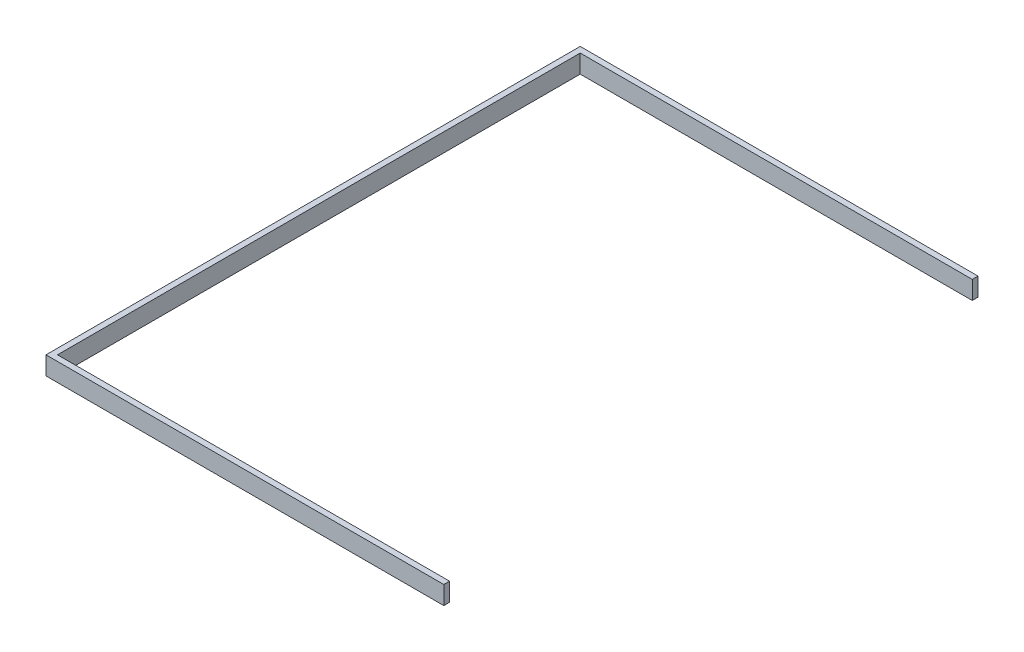
ISO-10303-21;
HEADER;
FILE_DESCRIPTION(('STEP AP214'),'2;1');
FILE_NAME('part.step','',(''),(''),'','','');
FILE_SCHEMA(('AUTOMOTIVE_DESIGN { 1 0 10303 214 1 1 1 1 }'));
ENDSEC;
DATA;
#1=APPLICATION_CONTEXT('core data for automotive mechanical design processes');
#2=APPLICATION_PROTOCOL_DEFINITION('international standard','automotive_design',2000,#1);
#3=PRODUCT_CONTEXT('',#1,'mechanical');
#4=PRODUCT('Part','Part','',(#3));
#5=PRODUCT_RELATED_PRODUCT_CATEGORY('part','',(#4));
#6=PRODUCT_DEFINITION_FORMATION('','',#4);
#7=PRODUCT_DEFINITION_CONTEXT('part definition',#1,'design');
#8=PRODUCT_DEFINITION('design','',#6,#7);
#9=PRODUCT_DEFINITION_SHAPE('','',#8);
#10=(LENGTH_UNIT() NAMED_UNIT(*) SI_UNIT(.MILLI.,.METRE.));
#11=(NAMED_UNIT(*) PLANE_ANGLE_UNIT() SI_UNIT($,.RADIAN.));
#12=(NAMED_UNIT(*) SI_UNIT($,.STERADIAN.) SOLID_ANGLE_UNIT());
#13=UNCERTAINTY_MEASURE_WITH_UNIT(LENGTH_MEASURE(1.E-05),#10,'distance_accuracy_value','');
#14=(GEOMETRIC_REPRESENTATION_CONTEXT(3) GLOBAL_UNCERTAINTY_ASSIGNED_CONTEXT((#13)) GLOBAL_UNIT_ASSIGNED_CONTEXT((#10,
#11,#12)) REPRESENTATION_CONTEXT('',''));
#15=CARTESIAN_POINT('',(0.,0.,0.));
#16=DIRECTION('',(0.,0.,1.));
#17=DIRECTION('',(1.,0.,0.));
#18=AXIS2_PLACEMENT_3D('',#15,#16,#17);
#19=CARTESIAN_POINT('',(22.,-0.01,2022.01));
#20=DIRECTION('',(1.,0.,0.));
#21=DIRECTION('',(0.,0.,-1.));
#22=AXIS2_PLACEMENT_3D('',#19,#20,#21);
#23=PLANE('',#22);
#24=DIRECTION('',(0.,0.,-1.));
#25=VECTOR('',#24,1.);
#26=CARTESIAN_POINT('',(22.,70.,1022.));
#27=LINE('',#26,#25);
#28=CARTESIAN_POINT('',(22.,70.,2022.));
#29=VERTEX_POINT('',#28);
#30=CARTESIAN_POINT('',(22.,70.,21.9999999999999));
#31=VERTEX_POINT('',#30);
#32=EDGE_CURVE('E136',#29,#31,#27,.T.);
#33=ORIENTED_EDGE('',*,*,#32,.F.);
#34=DIRECTION('',(0.,1.,0.));
#35=VECTOR('',#34,1.);
#36=CARTESIAN_POINT('',(22.0000000000001,35.,2022.));
#37=LINE('',#36,#35);
#38=CARTESIAN_POINT('',(22.0000000000001,0.,2022.));
#39=VERTEX_POINT('',#38);
#40=EDGE_CURVE('E125',#39,#29,#37,.T.);
#41=ORIENTED_EDGE('',*,*,#40,.F.);
#42=DIRECTION('',(0.,0.,1.));
#43=VECTOR('',#42,1.);
#44=CARTESIAN_POINT('',(22.0000000000001,0.,1022.));
#45=LINE('',#44,#43);
#46=CARTESIAN_POINT('',(22.,0.,22.));
#47=VERTEX_POINT('',#46);
#48=EDGE_CURVE('E124',#47,#39,#45,.T.);
#49=ORIENTED_EDGE('',*,*,#48,.F.);
#50=DIRECTION('',(0.,-1.,0.));
#51=VECTOR('',#50,1.);
#52=CARTESIAN_POINT('',(22.,35.,22.));
#53=LINE('',#52,#51);
#54=EDGE_CURVE('E21',#31,#47,#53,.T.);
#55=ORIENTED_EDGE('',*,*,#54,.F.);
#56=EDGE_LOOP('',(#33,#41,#49,#55));
#57=FACE_BOUND('',#56,.T.);
#58=ADVANCED_FACE('F17',(#57),#23,.T.);
#59=CARTESIAN_POINT('',(21.99,-0.01,22.));
#60=DIRECTION('',(0.,0.,1.));
#61=DIRECTION('',(1.,0.,0.));
#62=AXIS2_PLACEMENT_3D('',#59,#60,#61);
#63=PLANE('',#62);
#64=DIRECTION('',(1.,0.,0.));
#65=VECTOR('',#64,1.);
#66=CARTESIAN_POINT('',(761.,70.,22.));
#67=LINE('',#66,#65);
#68=CARTESIAN_POINT('',(1522.,70.,22.));
#69=VERTEX_POINT('',#68);
#70=EDGE_CURVE('E119',#31,#69,#67,.T.);
#71=ORIENTED_EDGE('',*,*,#70,.F.);
#72=ORIENTED_EDGE('',*,*,#54,.T.);
#73=DIRECTION('',(-1.,0.,0.));
#74=VECTOR('',#73,1.);
#75=CARTESIAN_POINT('',(761.,0.,22.0000000000001));
#76=LINE('',#75,#74);
#77=CARTESIAN_POINT('',(1522.,0.,22.));
#78=VERTEX_POINT('',#77);
#79=EDGE_CURVE('E117',#78,#47,#76,.T.);
#80=ORIENTED_EDGE('',*,*,#79,.F.);
#81=DIRECTION('',(0.,-1.,0.));
#82=VECTOR('',#81,1.);
#83=CARTESIAN_POINT('',(1522.,35.,22.));
#84=LINE('',#83,#82);
#85=EDGE_CURVE('E109',#69,#78,#84,.T.);
#86=ORIENTED_EDGE('',*,*,#85,.F.);
#87=EDGE_LOOP('',(#71,#72,#80,#86));
#88=FACE_BOUND('',#87,.T.);
#89=ADVANCED_FACE('F116',(#88),#63,.T.);
#90=CARTESIAN_POINT('',(1522.,-0.01,22.01));
#91=DIRECTION('',(1.,0.,0.));
#92=DIRECTION('',(0.,0.,-1.));
#93=AXIS2_PLACEMENT_3D('',#90,#91,#92);
#94=PLANE('',#93);
#95=DIRECTION('',(0.,0.,-1.));
#96=VECTOR('',#95,1.);
#97=CARTESIAN_POINT('',(1522.,70.,1022.));
#98=LINE('',#97,#96);
#99=CARTESIAN_POINT('',(1522.,70.,0.));
#100=VERTEX_POINT('',#99);
#101=EDGE_CURVE('E139',#69,#100,#98,.T.);
#102=ORIENTED_EDGE('',*,*,#101,.F.);
#103=ORIENTED_EDGE('',*,*,#85,.T.);
#104=DIRECTION('',(0.,0.,1.));
#105=VECTOR('',#104,1.);
#106=CARTESIAN_POINT('',(1522.,0.,1022.));
#107=LINE('',#106,#105);
#108=CARTESIAN_POINT('',(1522.,0.,0.));
#109=VERTEX_POINT('',#108);
#110=EDGE_CURVE('E99',#109,#78,#107,.T.);
#111=ORIENTED_EDGE('',*,*,#110,.F.);
#112=DIRECTION('',(0.,-1.,0.));
#113=VECTOR('',#112,1.);
#114=CARTESIAN_POINT('',(1522.,35.,0.));
#115=LINE('',#114,#113);
#116=EDGE_CURVE('E80',#100,#109,#115,.T.);
#117=ORIENTED_EDGE('',*,*,#116,.F.);
#118=EDGE_LOOP('',(#102,#103,#111,#117));
#119=FACE_BOUND('',#118,.T.);
#120=ADVANCED_FACE('F179',(#119),#94,.T.);
#121=CARTESIAN_POINT('',(1522.01,-0.01,0.));
#122=DIRECTION('',(0.,0.,-1.));
#123=DIRECTION('',(-1.,0.,0.));
#124=AXIS2_PLACEMENT_3D('',#121,#122,#123);
#125=PLANE('',#124);
#126=DIRECTION('',(-1.,0.,0.));
#127=VECTOR('',#126,1.);
#128=CARTESIAN_POINT('',(761.,70.,0.));
#129=LINE('',#128,#127);
#130=CARTESIAN_POINT('',(0.,70.,0.));
#131=VERTEX_POINT('',#130);
#132=EDGE_CURVE('E142',#100,#131,#129,.T.);
#133=ORIENTED_EDGE('',*,*,#132,.F.);
#134=ORIENTED_EDGE('',*,*,#116,.T.);
#135=DIRECTION('',(1.,0.,0.));
#136=VECTOR('',#135,1.);
#137=CARTESIAN_POINT('',(761.,0.,-1.11459371463299E-13));
#138=LINE('',#137,#136);
#139=CARTESIAN_POINT('',(0.,0.,0.));
#140=VERTEX_POINT('',#139);
#141=EDGE_CURVE('E95',#140,#109,#138,.T.);
#142=ORIENTED_EDGE('',*,*,#141,.F.);
#143=DIRECTION('',(0.,-1.,0.));
#144=VECTOR('',#143,1.);
#145=CARTESIAN_POINT('',(0.,35.,0.));
#146=LINE('',#145,#144);
#147=EDGE_CURVE('E85',#131,#140,#146,.T.);
#148=ORIENTED_EDGE('',*,*,#147,.F.);
#149=EDGE_LOOP('',(#133,#134,#142,#148));
#150=FACE_BOUND('',#149,.T.);
#151=ADVANCED_FACE('F96',(#150),#125,.T.);
#152=CARTESIAN_POINT('',(0.,-0.01,-0.01));
#153=DIRECTION('',(-1.,0.,0.));
#154=DIRECTION('',(0.,0.,1.));
#155=AXIS2_PLACEMENT_3D('',#152,#153,#154);
#156=PLANE('',#155);
#157=DIRECTION('',(0.,0.,1.));
#158=VECTOR('',#157,1.);
#159=CARTESIAN_POINT('',(0.,70.,1022.));
#160=LINE('',#159,#158);
#161=CARTESIAN_POINT('',(0.,70.,2044.));
#162=VERTEX_POINT('',#161);
#163=EDGE_CURVE('E91',#131,#162,#160,.T.);
#164=ORIENTED_EDGE('',*,*,#163,.F.);
#165=ORIENTED_EDGE('',*,*,#147,.T.);
#166=DIRECTION('',(0.,0.,-1.));
#167=VECTOR('',#166,1.);
#168=CARTESIAN_POINT('',(0.,0.,1022.));
#169=LINE('',#168,#167);
#170=CARTESIAN_POINT('',(0.,0.,2044.));
#171=VERTEX_POINT('',#170);
#172=EDGE_CURVE('E89',#171,#140,#169,.T.);
#173=ORIENTED_EDGE('',*,*,#172,.F.);
#174=DIRECTION('',(0.,-1.,0.));
#175=VECTOR('',#174,1.);
#176=CARTESIAN_POINT('',(0.,35.,2044.));
#177=LINE('',#176,#175);
#178=EDGE_CURVE('E147',#162,#171,#177,.T.);
#179=ORIENTED_EDGE('',*,*,#178,.F.);
#180=EDGE_LOOP('',(#164,#165,#173,#179));
#181=FACE_BOUND('',#180,.T.);
#182=ADVANCED_FACE('F86',(#181),#156,.T.);
#183=CARTESIAN_POINT('',(1522.01,0.,2044.01));
#184=DIRECTION('',(0.,-1.,0.));
#185=DIRECTION('',(-1.,0.,0.));
#186=AXIS2_PLACEMENT_3D('',#183,#184,#185);
#187=PLANE('',#186);
#188=ORIENTED_EDGE('',*,*,#79,.T.);
#189=ORIENTED_EDGE('',*,*,#48,.T.);
#190=DIRECTION('',(-1.,0.,0.));
#191=VECTOR('',#190,1.);
#192=CARTESIAN_POINT('',(772.,0.,2022.));
#193=LINE('',#192,#191);
#194=CARTESIAN_POINT('',(1522.,0.,2022.));
#195=VERTEX_POINT('',#194);
#196=EDGE_CURVE('E127',#195,#39,#193,.T.);
#197=ORIENTED_EDGE('',*,*,#196,.F.);
#198=DIRECTION('',(0.,0.,-1.));
#199=VECTOR('',#198,1.);
#200=CARTESIAN_POINT('',(1522.,0.,2033.));
#201=LINE('',#200,#199);
#202=CARTESIAN_POINT('',(1522.,0.,2044.));
#203=VERTEX_POINT('',#202);
#204=EDGE_CURVE('E149',#203,#195,#201,.T.);
#205=ORIENTED_EDGE('',*,*,#204,.F.);
#206=DIRECTION('',(1.,0.,0.));
#207=VECTOR('',#206,1.);
#208=CARTESIAN_POINT('',(761.,0.,2044.));
#209=LINE('',#208,#207);
#210=EDGE_CURVE('E104',#171,#203,#209,.T.);
#211=ORIENTED_EDGE('',*,*,#210,.F.);
#212=ORIENTED_EDGE('',*,*,#172,.T.);
#213=ORIENTED_EDGE('',*,*,#141,.T.);
#214=ORIENTED_EDGE('',*,*,#110,.T.);
#215=EDGE_LOOP('',(#188,#189,#197,#205,#211,#212,#213,#214));
#216=FACE_BOUND('',#215,.T.);
#217=ADVANCED_FACE('F102',(#216),#187,.T.);
#218=CARTESIAN_POINT('',(1522.01,-0.01,2022.));
#219=DIRECTION('',(0.,0.,-1.));
#220=DIRECTION('',(-1.,0.,0.));
#221=AXIS2_PLACEMENT_3D('',#218,#219,#220);
#222=PLANE('',#221);
#223=DIRECTION('',(-1.,0.,0.));
#224=VECTOR('',#223,1.);
#225=CARTESIAN_POINT('',(761.,70.,2022.));
#226=LINE('',#225,#224);
#227=CARTESIAN_POINT('',(1522.,70.,2022.));
#228=VERTEX_POINT('',#227);
#229=EDGE_CURVE('E133',#228,#29,#226,.T.);
#230=ORIENTED_EDGE('',*,*,#229,.F.);
#231=DIRECTION('',(0.,1.,0.));
#232=VECTOR('',#231,1.);
#233=CARTESIAN_POINT('',(1522.,35.,2022.));
#234=LINE('',#233,#232);
#235=EDGE_CURVE('E152',#195,#228,#234,.T.);
#236=ORIENTED_EDGE('',*,*,#235,.F.);
#237=ORIENTED_EDGE('',*,*,#196,.T.);
#238=ORIENTED_EDGE('',*,*,#40,.T.);
#239=EDGE_LOOP('',(#230,#236,#237,#238));
#240=FACE_BOUND('',#239,.T.);
#241=ADVANCED_FACE('F160',(#240),#222,.T.);
#242=CARTESIAN_POINT('',(-0.0100000000000477,70.,-0.0100000000000477));
#243=DIRECTION('',(0.,1.,0.));
#244=DIRECTION('',(0.,0.,1.));
#245=AXIS2_PLACEMENT_3D('',#242,#243,#244);
#246=PLANE('',#245);
#247=DIRECTION('',(-1.,0.,0.));
#248=VECTOR('',#247,1.);
#249=CARTESIAN_POINT('',(761.,70.,2044.));
#250=LINE('',#249,#248);
#251=CARTESIAN_POINT('',(1522.,70.,2044.));
#252=VERTEX_POINT('',#251);
#253=EDGE_CURVE('E36',#252,#162,#250,.T.);
#254=ORIENTED_EDGE('',*,*,#253,.F.);
#255=DIRECTION('',(0.,0.,1.));
#256=VECTOR('',#255,1.);
#257=CARTESIAN_POINT('',(1522.,70.,2033.));
#258=LINE('',#257,#256);
#259=EDGE_CURVE('E27',#228,#252,#258,.T.);
#260=ORIENTED_EDGE('',*,*,#259,.F.);
#261=ORIENTED_EDGE('',*,*,#229,.T.);
#262=ORIENTED_EDGE('',*,*,#32,.T.);
#263=ORIENTED_EDGE('',*,*,#70,.T.);
#264=ORIENTED_EDGE('',*,*,#101,.T.);
#265=ORIENTED_EDGE('',*,*,#132,.T.);
#266=ORIENTED_EDGE('',*,*,#163,.T.);
#267=EDGE_LOOP('',(#254,#260,#261,#262,#263,#264,#265,#266));
#268=FACE_BOUND('',#267,.T.);
#269=ADVANCED_FACE('F158',(#268),#246,.T.);
#270=CARTESIAN_POINT('',(-0.01,-0.01,2044.));
#271=DIRECTION('',(0.,0.,1.));
#272=DIRECTION('',(1.,0.,0.));
#273=AXIS2_PLACEMENT_3D('',#270,#271,#272);
#274=PLANE('',#273);
#275=ORIENTED_EDGE('',*,*,#253,.T.);
#276=ORIENTED_EDGE('',*,*,#178,.T.);
#277=ORIENTED_EDGE('',*,*,#210,.T.);
#278=DIRECTION('',(0.,-1.,0.));
#279=VECTOR('',#278,1.);
#280=CARTESIAN_POINT('',(1522.,35.,2044.));
#281=LINE('',#280,#279);
#282=EDGE_CURVE('E11',#252,#203,#281,.T.);
#283=ORIENTED_EDGE('',*,*,#282,.F.);
#284=EDGE_LOOP('',(#275,#276,#277,#283));
#285=FACE_BOUND('',#284,.T.);
#286=ADVANCED_FACE('F162',(#285),#274,.T.);
#287=CARTESIAN_POINT('',(1522.,-0.01,2044.01));
#288=DIRECTION('',(1.,0.,0.));
#289=DIRECTION('',(0.,0.,-1.));
#290=AXIS2_PLACEMENT_3D('',#287,#288,#289);
#291=PLANE('',#290);
#292=ORIENTED_EDGE('',*,*,#259,.T.);
#293=ORIENTED_EDGE('',*,*,#282,.T.);
#294=ORIENTED_EDGE('',*,*,#204,.T.);
#295=ORIENTED_EDGE('',*,*,#235,.T.);
#296=EDGE_LOOP('',(#292,#293,#294,#295));
#297=FACE_BOUND('',#296,.T.);
#298=ADVANCED_FACE('F19',(#297),#291,.T.);
#299=CLOSED_SHELL('',(#58,#89,#120,#151,#182,#217,#241,#269,#286,#298));
#300=MANIFOLD_SOLID_BREP('B1',#299);
#301=ADVANCED_BREP_SHAPE_REPRESENTATION('',(#18,#300),#14);
#302=SHAPE_DEFINITION_REPRESENTATION(#9,#301);
ENDSEC;
END-ISO-10303-21;
